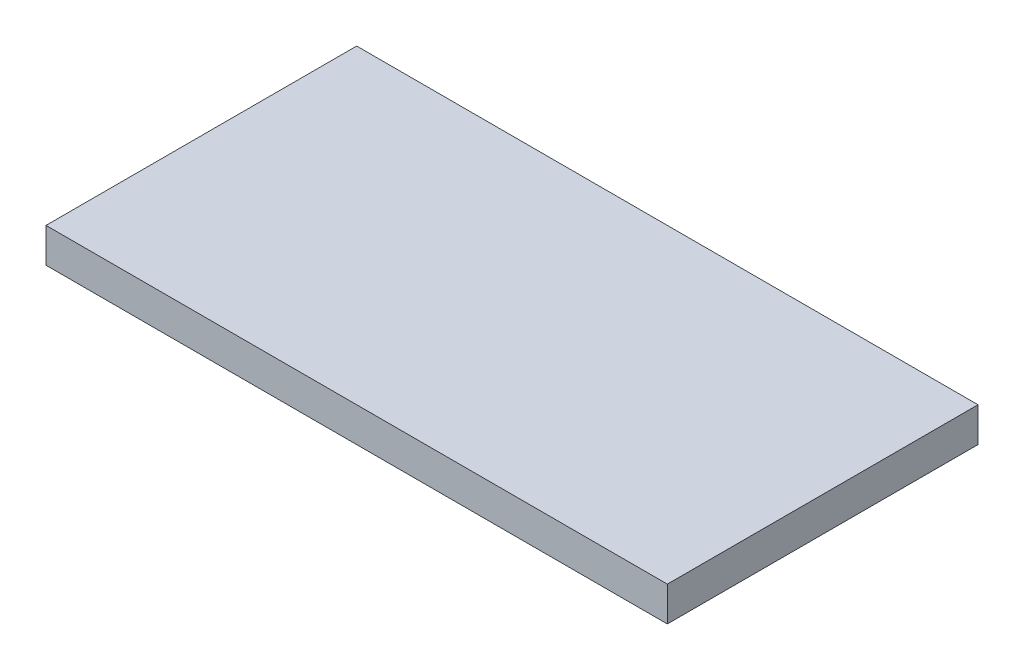
ISO-10303-21;
HEADER;
FILE_DESCRIPTION(('STEP AP214'),'2;1');
FILE_NAME('part.step','',(''),(''),'','','');
FILE_SCHEMA(('AUTOMOTIVE_DESIGN { 1 0 10303 214 1 1 1 1 }'));
ENDSEC;
DATA;
#1=APPLICATION_CONTEXT('core data for automotive mechanical design processes');
#2=APPLICATION_PROTOCOL_DEFINITION('international standard','automotive_design',2000,#1);
#3=PRODUCT_CONTEXT('',#1,'mechanical');
#4=PRODUCT('Part','Part','',(#3));
#5=PRODUCT_RELATED_PRODUCT_CATEGORY('part','',(#4));
#6=PRODUCT_DEFINITION_FORMATION('','',#4);
#7=PRODUCT_DEFINITION_CONTEXT('part definition',#1,'design');
#8=PRODUCT_DEFINITION('design','',#6,#7);
#9=PRODUCT_DEFINITION_SHAPE('','',#8);
#10=(LENGTH_UNIT() NAMED_UNIT(*) SI_UNIT(.MILLI.,.METRE.));
#11=(NAMED_UNIT(*) PLANE_ANGLE_UNIT() SI_UNIT($,.RADIAN.));
#12=(NAMED_UNIT(*) SI_UNIT($,.STERADIAN.) SOLID_ANGLE_UNIT());
#13=UNCERTAINTY_MEASURE_WITH_UNIT(LENGTH_MEASURE(1.E-05),#10,'distance_accuracy_value','');
#14=(GEOMETRIC_REPRESENTATION_CONTEXT(3) GLOBAL_UNCERTAINTY_ASSIGNED_CONTEXT((#13)) GLOBAL_UNIT_ASSIGNED_CONTEXT((#10,
#11,#12)) REPRESENTATION_CONTEXT('',''));
#15=CARTESIAN_POINT('',(0.,0.,0.));
#16=DIRECTION('',(0.,0.,1.));
#17=DIRECTION('',(1.,0.,0.));
#18=AXIS2_PLACEMENT_3D('',#15,#16,#17);
#19=CARTESIAN_POINT('',(0.,0.2,0.));
#20=DIRECTION('',(0.,1.,0.));
#21=DIRECTION('',(-1.,0.,0.));
#22=AXIS2_PLACEMENT_3D('',#19,#20,#21);
#23=PLANE('',#22);
#24=DIRECTION('',(0.,0.,1.));
#25=VECTOR('',#24,1.);
#26=CARTESIAN_POINT('',(1.79999999999997,0.200000000000014,-4.25000000000001));
#27=LINE('',#26,#25);
#28=CARTESIAN_POINT('',(1.79999999999997,0.200000000000014,-4.25000000000001));
#29=VERTEX_POINT('',#28);
#30=CARTESIAN_POINT('',(1.79999999999997,0.200000000000008,-2.44999999999999));
#31=VERTEX_POINT('',#30);
#32=EDGE_CURVE('E11',#29,#31,#27,.T.);
#33=ORIENTED_EDGE('',*,*,#32,.F.);
#34=DIRECTION('',(1.,0.,0.));
#35=VECTOR('',#34,1.);
#36=CARTESIAN_POINT('',(1.79999999999997,0.200000000000014,-4.25000000000001));
#37=LINE('',#36,#35);
#38=CARTESIAN_POINT('',(-1.80000000000002,0.200000000000014,-4.25000000000001));
#39=VERTEX_POINT('',#38);
#40=EDGE_CURVE('E24',#39,#29,#37,.T.);
#41=ORIENTED_EDGE('',*,*,#40,.F.);
#42=DIRECTION('',(0.,0.,-1.));
#43=VECTOR('',#42,1.);
#44=CARTESIAN_POINT('',(-1.80000000000002,0.200000000000014,-4.25000000000001));
#45=LINE('',#44,#43);
#46=CARTESIAN_POINT('',(-1.80000000000002,0.200000000000008,-2.44999999999999));
#47=VERTEX_POINT('',#46);
#48=EDGE_CURVE('E75',#47,#39,#45,.T.);
#49=ORIENTED_EDGE('',*,*,#48,.F.);
#50=DIRECTION('',(-1.,0.,0.));
#51=VECTOR('',#50,1.);
#52=CARTESIAN_POINT('',(1.79999999999997,0.200000000000008,-2.44999999999999));
#53=LINE('',#52,#51);
#54=EDGE_CURVE('E85',#31,#47,#53,.T.);
#55=ORIENTED_EDGE('',*,*,#54,.F.);
#56=EDGE_LOOP('',(#33,#41,#49,#55));
#57=FACE_BOUND('',#56,.T.);
#58=ADVANCED_FACE('F17',(#57),#23,.T.);
#59=CARTESIAN_POINT('',(0.,0.,0.));
#60=DIRECTION('',(0.,-1.,0.));
#61=DIRECTION('',(0.,0.,-1.));
#62=AXIS2_PLACEMENT_3D('',#59,#60,#61);
#63=PLANE('',#62);
#64=DIRECTION('',(0.,0.,1.));
#65=VECTOR('',#64,1.);
#66=CARTESIAN_POINT('',(1.79999999999997,0.,-4.25000000000001));
#67=LINE('',#66,#65);
#68=CARTESIAN_POINT('',(1.79999999999997,0.,-4.25000000000001));
#69=VERTEX_POINT('',#68);
#70=CARTESIAN_POINT('',(1.79999999999997,0.,-2.44999999999999));
#71=VERTEX_POINT('',#70);
#72=EDGE_CURVE('E83',#69,#71,#67,.T.);
#73=ORIENTED_EDGE('',*,*,#72,.T.);
#74=DIRECTION('',(-1.,0.,0.));
#75=VECTOR('',#74,1.);
#76=CARTESIAN_POINT('',(1.79999999999997,0.,-2.44999999999999));
#77=LINE('',#76,#75);
#78=CARTESIAN_POINT('',(-1.80000000000002,0.,-2.44999999999999));
#79=VERTEX_POINT('',#78);
#80=EDGE_CURVE('E60',#71,#79,#77,.T.);
#81=ORIENTED_EDGE('',*,*,#80,.T.);
#82=DIRECTION('',(0.,0.,-1.));
#83=VECTOR('',#82,1.);
#84=CARTESIAN_POINT('',(-1.80000000000002,0.,-4.25000000000001));
#85=LINE('',#84,#83);
#86=CARTESIAN_POINT('',(-1.80000000000002,0.,-4.25000000000001));
#87=VERTEX_POINT('',#86);
#88=EDGE_CURVE('E54',#79,#87,#85,.T.);
#89=ORIENTED_EDGE('',*,*,#88,.T.);
#90=DIRECTION('',(1.,0.,0.));
#91=VECTOR('',#90,1.);
#92=CARTESIAN_POINT('',(1.79999999999997,0.,-4.25000000000001));
#93=LINE('',#92,#91);
#94=EDGE_CURVE('E57',#87,#69,#93,.T.);
#95=ORIENTED_EDGE('',*,*,#94,.T.);
#96=EDGE_LOOP('',(#73,#81,#89,#95));
#97=FACE_BOUND('',#96,.T.);
#98=ADVANCED_FACE('F56',(#97),#63,.T.);
#99=CARTESIAN_POINT('',(1.79999999999997,4.22492235949963,-2.44999999999997));
#100=DIRECTION('',(0.,0.,1.));
#101=DIRECTION('',(0.,-1.,0.));
#102=AXIS2_PLACEMENT_3D('',#99,#100,#101);
#103=PLANE('',#102);
#104=DIRECTION('',(0.,-1.,0.));
#105=VECTOR('',#104,1.);
#106=CARTESIAN_POINT('',(1.79999999999997,4.22492235949963,-2.44999999999997));
#107=LINE('',#106,#105);
#108=EDGE_CURVE('E71',#31,#71,#107,.T.);
#109=ORIENTED_EDGE('',*,*,#108,.F.);
#110=ORIENTED_EDGE('',*,*,#54,.T.);
#111=DIRECTION('',(0.,-1.,0.));
#112=VECTOR('',#111,1.);
#113=CARTESIAN_POINT('',(-1.80000000000002,4.22492235949963,-2.44999999999997));
#114=LINE('',#113,#112);
#115=EDGE_CURVE('E76',#47,#79,#114,.T.);
#116=ORIENTED_EDGE('',*,*,#115,.T.);
#117=ORIENTED_EDGE('',*,*,#80,.F.);
#118=EDGE_LOOP('',(#109,#110,#116,#117));
#119=FACE_BOUND('',#118,.T.);
#120=ADVANCED_FACE('F91',(#119),#103,.T.);
#121=CARTESIAN_POINT('',(-1.80000000000002,4.22492235949964,-4.25));
#122=DIRECTION('',(-1.,0.,0.));
#123=DIRECTION('',(0.,-1.,0.));
#124=AXIS2_PLACEMENT_3D('',#121,#122,#123);
#125=PLANE('',#124);
#126=ORIENTED_EDGE('',*,*,#115,.F.);
#127=ORIENTED_EDGE('',*,*,#48,.T.);
#128=DIRECTION('',(0.,-1.,0.));
#129=VECTOR('',#128,1.);
#130=CARTESIAN_POINT('',(-1.80000000000002,4.22492235949964,-4.25));
#131=LINE('',#130,#129);
#132=EDGE_CURVE('E69',#39,#87,#131,.T.);
#133=ORIENTED_EDGE('',*,*,#132,.T.);
#134=ORIENTED_EDGE('',*,*,#88,.F.);
#135=EDGE_LOOP('',(#126,#127,#133,#134));
#136=FACE_BOUND('',#135,.T.);
#137=ADVANCED_FACE('F74',(#136),#125,.T.);
#138=CARTESIAN_POINT('',(1.79999999999997,4.22492235949964,-4.25));
#139=DIRECTION('',(0.,0.,-1.));
#140=DIRECTION('',(0.,1.,0.));
#141=AXIS2_PLACEMENT_3D('',#138,#139,#140);
#142=PLANE('',#141);
#143=ORIENTED_EDGE('',*,*,#132,.F.);
#144=ORIENTED_EDGE('',*,*,#40,.T.);
#145=DIRECTION('',(0.,-1.,0.));
#146=VECTOR('',#145,1.);
#147=CARTESIAN_POINT('',(1.79999999999997,4.22492235949964,-4.25));
#148=LINE('',#147,#146);
#149=EDGE_CURVE('E70',#29,#69,#148,.T.);
#150=ORIENTED_EDGE('',*,*,#149,.T.);
#151=ORIENTED_EDGE('',*,*,#94,.F.);
#152=EDGE_LOOP('',(#143,#144,#150,#151));
#153=FACE_BOUND('',#152,.T.);
#154=ADVANCED_FACE('F68',(#153),#142,.T.);
#155=CARTESIAN_POINT('',(1.79999999999997,4.22492235949964,-4.25));
#156=DIRECTION('',(1.,0.,0.));
#157=DIRECTION('',(0.,1.,0.));
#158=AXIS2_PLACEMENT_3D('',#155,#156,#157);
#159=PLANE('',#158);
#160=ORIENTED_EDGE('',*,*,#149,.F.);
#161=ORIENTED_EDGE('',*,*,#32,.T.);
#162=ORIENTED_EDGE('',*,*,#108,.T.);
#163=ORIENTED_EDGE('',*,*,#72,.F.);
#164=EDGE_LOOP('',(#160,#161,#162,#163));
#165=FACE_BOUND('',#164,.T.);
#166=ADVANCED_FACE('F88',(#165),#159,.T.);
#167=CLOSED_SHELL('',(#58,#98,#120,#137,#154,#166));
#168=MANIFOLD_SOLID_BREP('B1',#167);
#169=ADVANCED_BREP_SHAPE_REPRESENTATION('',(#18,#168),#14);
#170=SHAPE_DEFINITION_REPRESENTATION(#9,#169);
ENDSEC;
END-ISO-10303-21;
